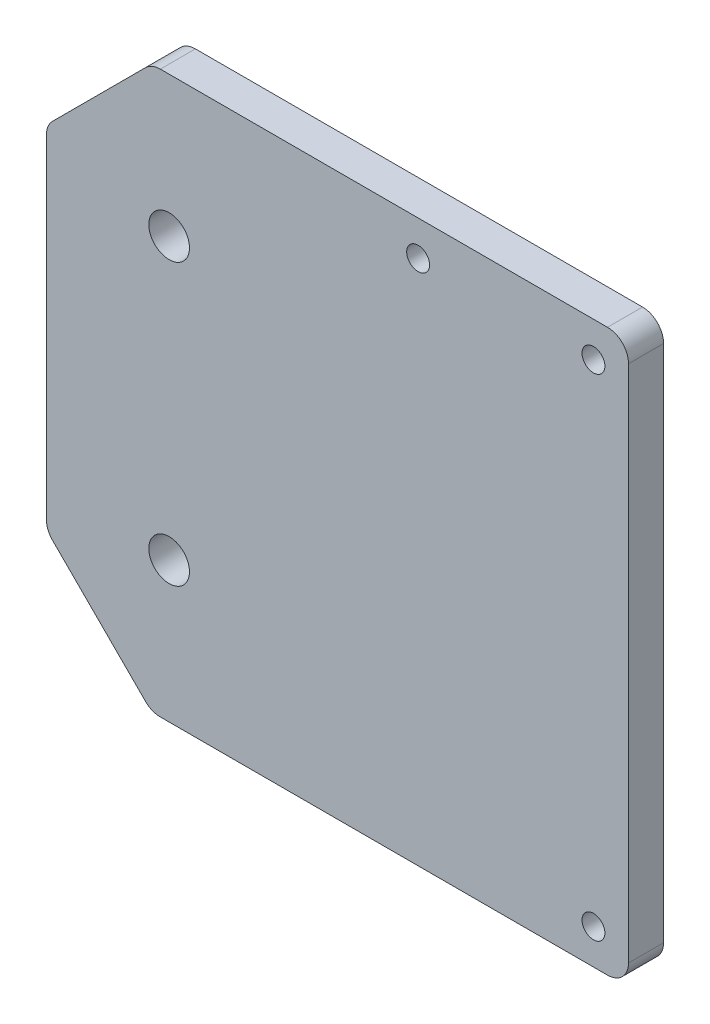
ISO-10303-21;
HEADER;
FILE_DESCRIPTION(('STEP AP214'),'2;1');
FILE_NAME('part.step','',(''),(''),'','','');
FILE_SCHEMA(('AUTOMOTIVE_DESIGN { 1 0 10303 214 1 1 1 1 }'));
ENDSEC;
DATA;
#1=APPLICATION_CONTEXT('core data for automotive mechanical design processes');
#2=APPLICATION_PROTOCOL_DEFINITION('international standard','automotive_design',2000,#1);
#3=PRODUCT_CONTEXT('',#1,'mechanical');
#4=PRODUCT('Part','Part','',(#3));
#5=PRODUCT_RELATED_PRODUCT_CATEGORY('part','',(#4));
#6=PRODUCT_DEFINITION_FORMATION('','',#4);
#7=PRODUCT_DEFINITION_CONTEXT('part definition',#1,'design');
#8=PRODUCT_DEFINITION('design','',#6,#7);
#9=PRODUCT_DEFINITION_SHAPE('','',#8);
#10=(LENGTH_UNIT() NAMED_UNIT(*) SI_UNIT(.MILLI.,.METRE.));
#11=(NAMED_UNIT(*) PLANE_ANGLE_UNIT() SI_UNIT($,.RADIAN.));
#12=(NAMED_UNIT(*) SI_UNIT($,.STERADIAN.) SOLID_ANGLE_UNIT());
#13=UNCERTAINTY_MEASURE_WITH_UNIT(LENGTH_MEASURE(1.E-05),#10,'distance_accuracy_value','');
#14=(GEOMETRIC_REPRESENTATION_CONTEXT(3) GLOBAL_UNCERTAINTY_ASSIGNED_CONTEXT((#13)) GLOBAL_UNIT_ASSIGNED_CONTEXT((#10,
#11,#12)) REPRESENTATION_CONTEXT('',''));
#15=CARTESIAN_POINT('',(0.,0.,0.));
#16=DIRECTION('',(0.,0.,1.));
#17=DIRECTION('',(1.,0.,0.));
#18=AXIS2_PLACEMENT_3D('',#15,#16,#17);
#19=CARTESIAN_POINT('',(0.,40.,5.));
#20=DIRECTION('',(0.,1.,0.));
#21=DIRECTION('',(0.,0.,1.));
#22=AXIS2_PLACEMENT_3D('',#19,#20,#21);
#23=PLANE('',#22);
#24=DIRECTION('',(1.,0.,0.));
#25=VECTOR('',#24,1.);
#26=CARTESIAN_POINT('',(0.,40.,0.));
#27=LINE('',#26,#25);
#28=CARTESIAN_POINT('',(-23.5332044962727,40.,0.));
#29=VERTEX_POINT('',#28);
#30=CARTESIAN_POINT('',(40.224154816608,40.,0.));
#31=VERTEX_POINT('',#30);
#32=EDGE_CURVE('E237',#29,#31,#27,.T.);
#33=ORIENTED_EDGE('',*,*,#32,.F.);
#34=DIRECTION('',(0.,0.,1.));
#35=VECTOR('',#34,1.);
#36=CARTESIAN_POINT('',(-23.5332044962727,40.,5.));
#37=LINE('',#36,#35);
#38=CARTESIAN_POINT('',(-23.5332044962727,40.,5.));
#39=VERTEX_POINT('',#38);
#40=EDGE_CURVE('E175',#29,#39,#37,.T.);
#41=ORIENTED_EDGE('',*,*,#40,.T.);
#42=DIRECTION('',(1.,0.,0.));
#43=VECTOR('',#42,1.);
#44=CARTESIAN_POINT('',(0.,40.,5.));
#45=LINE('',#44,#43);
#46=CARTESIAN_POINT('',(40.224154816608,40.,5.));
#47=VERTEX_POINT('',#46);
#48=EDGE_CURVE('E188',#39,#47,#45,.T.);
#49=ORIENTED_EDGE('',*,*,#48,.T.);
#50=DIRECTION('',(0.,0.,-1.));
#51=VECTOR('',#50,1.);
#52=CARTESIAN_POINT('',(40.224154816608,40.,5.));
#53=LINE('',#52,#51);
#54=EDGE_CURVE('E172',#47,#31,#53,.T.);
#55=ORIENTED_EDGE('',*,*,#54,.T.);
#56=EDGE_LOOP('',(#33,#41,#49,#55));
#57=FACE_BOUND('',#56,.T.);
#58=ADVANCED_FACE('F34',(#57),#23,.T.);
#59=CARTESIAN_POINT('',(-39.775845183392,0.,5.));
#60=DIRECTION('',(1.,0.,0.));
#61=DIRECTION('',(0.,0.,-1.));
#62=AXIS2_PLACEMENT_3D('',#59,#60,#61);
#63=PLANE('',#62);
#64=DIRECTION('',(0.,-1.,0.));
#65=VECTOR('',#64,1.);
#66=CARTESIAN_POINT('',(-39.775845183392,0.,0.));
#67=LINE('',#66,#65);
#68=CARTESIAN_POINT('',(-39.775845183392,23.7573593128807,0.));
#69=VERTEX_POINT('',#68);
#70=CARTESIAN_POINT('',(-39.775845183392,-23.7573593128807,0.));
#71=VERTEX_POINT('',#70);
#72=EDGE_CURVE('E192',#69,#71,#67,.T.);
#73=ORIENTED_EDGE('',*,*,#72,.T.);
#74=DIRECTION('',(0.,0.,1.));
#75=VECTOR('',#74,1.);
#76=CARTESIAN_POINT('',(-39.775845183392,-23.7573593128807,5.));
#77=LINE('',#76,#75);
#78=CARTESIAN_POINT('',(-39.775845183392,-23.7573593128807,5.));
#79=VERTEX_POINT('',#78);
#80=EDGE_CURVE('E166',#71,#79,#77,.T.);
#81=ORIENTED_EDGE('',*,*,#80,.T.);
#82=DIRECTION('',(0.,-1.,0.));
#83=VECTOR('',#82,1.);
#84=CARTESIAN_POINT('',(-39.775845183392,0.,5.));
#85=LINE('',#84,#83);
#86=CARTESIAN_POINT('',(-39.775845183392,23.7573593128807,5.));
#87=VERTEX_POINT('',#86);
#88=EDGE_CURVE('E145',#87,#79,#85,.T.);
#89=ORIENTED_EDGE('',*,*,#88,.F.);
#90=DIRECTION('',(0.,0.,-1.));
#91=VECTOR('',#90,1.);
#92=CARTESIAN_POINT('',(-39.775845183392,23.7573593128807,0.));
#93=LINE('',#92,#91);
#94=EDGE_CURVE('E163',#87,#69,#93,.T.);
#95=ORIENTED_EDGE('',*,*,#94,.T.);
#96=EDGE_LOOP('',(#73,#81,#89,#95));
#97=FACE_BOUND('',#96,.T.);
#98=ADVANCED_FACE('F230',(#97),#63,.F.);
#99=CARTESIAN_POINT('',(0.,-40.,5.));
#100=DIRECTION('',(0.,-1.,0.));
#101=DIRECTION('',(0.,0.,-1.));
#102=AXIS2_PLACEMENT_3D('',#99,#100,#101);
#103=PLANE('',#102);
#104=DIRECTION('',(-1.,0.,0.));
#105=VECTOR('',#104,1.);
#106=CARTESIAN_POINT('',(0.,-40.,5.));
#107=LINE('',#106,#105);
#108=CARTESIAN_POINT('',(40.224154816608,-40.,5.));
#109=VERTEX_POINT('',#108);
#110=CARTESIAN_POINT('',(-23.5332044962727,-40.,5.));
#111=VERTEX_POINT('',#110);
#112=EDGE_CURVE('E128',#109,#111,#107,.T.);
#113=ORIENTED_EDGE('',*,*,#112,.T.);
#114=DIRECTION('',(0.,0.,-1.));
#115=VECTOR('',#114,1.);
#116=CARTESIAN_POINT('',(-23.5332044962727,-40.,5.));
#117=LINE('',#116,#115);
#118=CARTESIAN_POINT('',(-23.5332044962727,-40.,0.));
#119=VERTEX_POINT('',#118);
#120=EDGE_CURVE('E134',#111,#119,#117,.T.);
#121=ORIENTED_EDGE('',*,*,#120,.T.);
#122=DIRECTION('',(-1.,0.,0.));
#123=VECTOR('',#122,1.);
#124=CARTESIAN_POINT('',(0.,-40.,0.));
#125=LINE('',#124,#123);
#126=CARTESIAN_POINT('',(40.224154816608,-40.,0.));
#127=VERTEX_POINT('',#126);
#128=EDGE_CURVE('E131',#127,#119,#125,.T.);
#129=ORIENTED_EDGE('',*,*,#128,.F.);
#130=DIRECTION('',(0.,0.,-1.));
#131=VECTOR('',#130,1.);
#132=CARTESIAN_POINT('',(40.224154816608,-40.,5.));
#133=LINE('',#132,#131);
#134=EDGE_CURVE('E124',#127,#109,#133,.F.);
#135=ORIENTED_EDGE('',*,*,#134,.T.);
#136=EDGE_LOOP('',(#113,#121,#129,#135));
#137=FACE_BOUND('',#136,.T.);
#138=ADVANCED_FACE('F126',(#137),#103,.T.);
#139=CARTESIAN_POINT('',(43.224154816608,0.,5.));
#140=DIRECTION('',(1.,0.,0.));
#141=DIRECTION('',(0.,0.,-1.));
#142=AXIS2_PLACEMENT_3D('',#139,#140,#141);
#143=PLANE('',#142);
#144=DIRECTION('',(0.,-1.,0.));
#145=VECTOR('',#144,1.);
#146=CARTESIAN_POINT('',(43.224154816608,0.,0.));
#147=LINE('',#146,#145);
#148=CARTESIAN_POINT('',(43.224154816608,37.,0.));
#149=VERTEX_POINT('',#148);
#150=CARTESIAN_POINT('',(43.224154816608,-37.,0.));
#151=VERTEX_POINT('',#150);
#152=EDGE_CURVE('E181',#149,#151,#147,.T.);
#153=ORIENTED_EDGE('',*,*,#152,.F.);
#154=DIRECTION('',(0.,0.,-1.));
#155=VECTOR('',#154,1.);
#156=CARTESIAN_POINT('',(43.224154816608,37.,5.));
#157=LINE('',#156,#155);
#158=CARTESIAN_POINT('',(43.224154816608,37.,5.));
#159=VERTEX_POINT('',#158);
#160=EDGE_CURVE('E11',#149,#159,#157,.F.);
#161=ORIENTED_EDGE('',*,*,#160,.T.);
#162=DIRECTION('',(0.,-1.,0.));
#163=VECTOR('',#162,1.);
#164=CARTESIAN_POINT('',(43.224154816608,0.,5.));
#165=LINE('',#164,#163);
#166=CARTESIAN_POINT('',(43.224154816608,-37.,5.));
#167=VERTEX_POINT('',#166);
#168=EDGE_CURVE('E144',#159,#167,#165,.T.);
#169=ORIENTED_EDGE('',*,*,#168,.T.);
#170=DIRECTION('',(0.,0.,-1.));
#171=VECTOR('',#170,1.);
#172=CARTESIAN_POINT('',(43.224154816608,-37.,5.));
#173=LINE('',#172,#171);
#174=EDGE_CURVE('E42',#167,#151,#173,.T.);
#175=ORIENTED_EDGE('',*,*,#174,.T.);
#176=EDGE_LOOP('',(#153,#161,#169,#175));
#177=FACE_BOUND('',#176,.T.);
#178=ADVANCED_FACE('F180',(#177),#143,.T.);
#179=CARTESIAN_POINT('',(0.,0.,5.));
#180=DIRECTION('',(0.,0.,1.));
#181=DIRECTION('',(1.,0.,0.));
#182=AXIS2_PLACEMENT_3D('',#179,#180,#181);
#183=PLANE('',#182);
#184=CARTESIAN_POINT('',(13.224154816608,35.,5.));
#185=DIRECTION('',(0.,0.,1.));
#186=DIRECTION('',(1.,0.,0.));
#187=AXIS2_PLACEMENT_3D('',#184,#185,#186);
#188=CIRCLE('',#187,1.63195);
#189=CARTESIAN_POINT('',(14.856104816608,35.,5.));
#190=VERTEX_POINT('',#189);
#191=EDGE_CURVE('E268',#190,#190,#188,.T.);
#192=ORIENTED_EDGE('',*,*,#191,.F.);
#193=EDGE_LOOP('',(#192));
#194=FACE_BOUND('',#193,.T.);
#195=CARTESIAN_POINT('',(38.224154816608,35.,5.));
#196=DIRECTION('',(0.,0.,1.));
#197=DIRECTION('',(1.,0.,0.));
#198=AXIS2_PLACEMENT_3D('',#195,#196,#197);
#199=CIRCLE('',#198,1.63195);
#200=CARTESIAN_POINT('',(39.856104816608,35.,5.));
#201=VERTEX_POINT('',#200);
#202=EDGE_CURVE('E262',#201,#201,#199,.T.);
#203=ORIENTED_EDGE('',*,*,#202,.F.);
#204=EDGE_LOOP('',(#203));
#205=FACE_BOUND('',#204,.T.);
#206=CARTESIAN_POINT('',(38.224154816608,-35.,5.));
#207=DIRECTION('',(0.,0.,1.));
#208=DIRECTION('',(1.,0.,0.));
#209=AXIS2_PLACEMENT_3D('',#206,#207,#208);
#210=CIRCLE('',#209,1.63195);
#211=CARTESIAN_POINT('',(39.856104816608,-35.,5.));
#212=VERTEX_POINT('',#211);
#213=EDGE_CURVE('E256',#212,#212,#210,.T.);
#214=ORIENTED_EDGE('',*,*,#213,.F.);
#215=EDGE_LOOP('',(#214));
#216=FACE_BOUND('',#215,.T.);
#217=CARTESIAN_POINT('',(-22.275845183392,-20.,5.));
#218=DIRECTION('',(0.,0.,1.));
#219=DIRECTION('',(1.,0.,0.));
#220=AXIS2_PLACEMENT_3D('',#217,#218,#219);
#221=CIRCLE('',#220,2.9);
#222=CARTESIAN_POINT('',(-19.375845183392,-20.,5.));
#223=VERTEX_POINT('',#222);
#224=EDGE_CURVE('E250',#223,#223,#221,.T.);
#225=ORIENTED_EDGE('',*,*,#224,.F.);
#226=EDGE_LOOP('',(#225));
#227=FACE_BOUND('',#226,.T.);
#228=CARTESIAN_POINT('',(-22.275845183392,20.,5.));
#229=DIRECTION('',(0.,0.,1.));
#230=DIRECTION('',(1.,0.,0.));
#231=AXIS2_PLACEMENT_3D('',#228,#229,#230);
#232=CIRCLE('',#231,2.9);
#233=CARTESIAN_POINT('',(-19.375845183392,20.,5.));
#234=VERTEX_POINT('',#233);
#235=EDGE_CURVE('E241',#234,#234,#232,.T.);
#236=ORIENTED_EDGE('',*,*,#235,.F.);
#237=EDGE_LOOP('',(#236));
#238=FACE_BOUND('',#237,.T.);
#239=DIRECTION('',(0.707106781186546,-0.707106781186549,0.));
#240=VECTOR('',#239,1.);
#241=CARTESIAN_POINT('',(-32.3879225916961,-32.3879225916959,5.));
#242=LINE('',#241,#240);
#243=CARTESIAN_POINT('',(-38.8971655269517,-25.8786796564403,5.));
#244=VERTEX_POINT('',#243);
#245=CARTESIAN_POINT('',(-25.6545248398324,-39.1213203435596,5.));
#246=VERTEX_POINT('',#245);
#247=EDGE_CURVE('E135',#244,#246,#242,.T.);
#248=ORIENTED_EDGE('',*,*,#247,.T.);
#249=CARTESIAN_POINT('',(-23.5332044962727,-37.,5.));
#250=DIRECTION('',(0.,0.,1.));
#251=DIRECTION('',(1.,0.,0.));
#252=AXIS2_PLACEMENT_3D('',#249,#250,#251);
#253=CIRCLE('',#252,3.);
#254=EDGE_CURVE('E143',#246,#111,#253,.T.);
#255=ORIENTED_EDGE('',*,*,#254,.T.);
#256=ORIENTED_EDGE('',*,*,#112,.F.);
#257=CARTESIAN_POINT('',(40.224154816608,-37.,5.));
#258=DIRECTION('',(0.,0.,1.));
#259=DIRECTION('',(1.,0.,0.));
#260=AXIS2_PLACEMENT_3D('',#257,#258,#259);
#261=CIRCLE('',#260,3.);
#262=EDGE_CURVE('E140',#109,#167,#261,.T.);
#263=ORIENTED_EDGE('',*,*,#262,.T.);
#264=ORIENTED_EDGE('',*,*,#168,.F.);
#265=CARTESIAN_POINT('',(40.224154816608,37.,5.));
#266=DIRECTION('',(0.,0.,1.));
#267=DIRECTION('',(1.,0.,0.));
#268=AXIS2_PLACEMENT_3D('',#265,#266,#267);
#269=CIRCLE('',#268,3.);
#270=EDGE_CURVE('E149',#159,#47,#269,.T.);
#271=ORIENTED_EDGE('',*,*,#270,.T.);
#272=ORIENTED_EDGE('',*,*,#48,.F.);
#273=CARTESIAN_POINT('',(-23.5332044962727,37.,5.));
#274=DIRECTION('',(0.,0.,1.));
#275=DIRECTION('',(1.,0.,0.));
#276=AXIS2_PLACEMENT_3D('',#273,#274,#275);
#277=CIRCLE('',#276,3.);
#278=CARTESIAN_POINT('',(-25.6545248398323,39.1213203435596,5.));
#279=VERTEX_POINT('',#278);
#280=EDGE_CURVE('E56',#39,#279,#277,.T.);
#281=ORIENTED_EDGE('',*,*,#280,.T.);
#282=DIRECTION('',(-0.707106781186549,-0.707106781186546,0.));
#283=VECTOR('',#282,1.);
#284=CARTESIAN_POINT('',(-32.3879225916959,32.3879225916961,5.));
#285=LINE('',#284,#283);
#286=CARTESIAN_POINT('',(-38.8971655269516,25.8786796564404,5.));
#287=VERTEX_POINT('',#286);
#288=EDGE_CURVE('E202',#279,#287,#285,.T.);
#289=ORIENTED_EDGE('',*,*,#288,.T.);
#290=CARTESIAN_POINT('',(-36.775845183392,23.7573593128807,5.));
#291=DIRECTION('',(0.,0.,1.));
#292=DIRECTION('',(1.,0.,0.));
#293=AXIS2_PLACEMENT_3D('',#290,#291,#292);
#294=CIRCLE('',#293,3.);
#295=EDGE_CURVE('E158',#287,#87,#294,.T.);
#296=ORIENTED_EDGE('',*,*,#295,.T.);
#297=ORIENTED_EDGE('',*,*,#88,.T.);
#298=CARTESIAN_POINT('',(-36.775845183392,-23.7573593128807,5.));
#299=DIRECTION('',(0.,0.,1.));
#300=DIRECTION('',(1.,0.,0.));
#301=AXIS2_PLACEMENT_3D('',#298,#299,#300);
#302=CIRCLE('',#301,3.);
#303=EDGE_CURVE('E160',#79,#244,#302,.T.);
#304=ORIENTED_EDGE('',*,*,#303,.T.);
#305=EDGE_LOOP('',(#248,#255,#256,#263,#264,#271,#272,#281,#289,#296,#297,#304));
#306=FACE_BOUND('',#305,.T.);
#307=ADVANCED_FACE('F138',(#194,#205,#216,#227,#238,#306),#183,.T.);
#308=CARTESIAN_POINT('',(0.,0.,0.));
#309=DIRECTION('',(0.,0.,1.));
#310=DIRECTION('',(1.,0.,0.));
#311=AXIS2_PLACEMENT_3D('',#308,#309,#310);
#312=PLANE('',#311);
#313=CARTESIAN_POINT('',(13.224154816608,35.,0.));
#314=DIRECTION('',(0.,0.,1.));
#315=DIRECTION('',(1.,0.,0.));
#316=AXIS2_PLACEMENT_3D('',#313,#314,#315);
#317=CIRCLE('',#316,1.63195);
#318=CARTESIAN_POINT('',(14.856104816608,35.,0.));
#319=VERTEX_POINT('',#318);
#320=EDGE_CURVE('E265',#319,#319,#317,.T.);
#321=ORIENTED_EDGE('',*,*,#320,.T.);
#322=EDGE_LOOP('',(#321));
#323=FACE_BOUND('',#322,.T.);
#324=CARTESIAN_POINT('',(38.224154816608,35.,0.));
#325=DIRECTION('',(0.,0.,1.));
#326=DIRECTION('',(1.,0.,0.));
#327=AXIS2_PLACEMENT_3D('',#324,#325,#326);
#328=CIRCLE('',#327,1.63195);
#329=CARTESIAN_POINT('',(39.856104816608,35.,0.));
#330=VERTEX_POINT('',#329);
#331=EDGE_CURVE('E259',#330,#330,#328,.T.);
#332=ORIENTED_EDGE('',*,*,#331,.T.);
#333=EDGE_LOOP('',(#332));
#334=FACE_BOUND('',#333,.T.);
#335=CARTESIAN_POINT('',(38.224154816608,-35.,0.));
#336=DIRECTION('',(0.,0.,1.));
#337=DIRECTION('',(1.,0.,0.));
#338=AXIS2_PLACEMENT_3D('',#335,#336,#337);
#339=CIRCLE('',#338,1.63195);
#340=CARTESIAN_POINT('',(39.856104816608,-35.,0.));
#341=VERTEX_POINT('',#340);
#342=EDGE_CURVE('E253',#341,#341,#339,.T.);
#343=ORIENTED_EDGE('',*,*,#342,.T.);
#344=EDGE_LOOP('',(#343));
#345=FACE_BOUND('',#344,.T.);
#346=CARTESIAN_POINT('',(-22.275845183392,-20.,0.));
#347=DIRECTION('',(0.,0.,1.));
#348=DIRECTION('',(1.,0.,0.));
#349=AXIS2_PLACEMENT_3D('',#346,#347,#348);
#350=CIRCLE('',#349,2.9);
#351=CARTESIAN_POINT('',(-19.375845183392,-20.,0.));
#352=VERTEX_POINT('',#351);
#353=EDGE_CURVE('E245',#352,#352,#350,.T.);
#354=ORIENTED_EDGE('',*,*,#353,.T.);
#355=EDGE_LOOP('',(#354));
#356=FACE_BOUND('',#355,.T.);
#357=CARTESIAN_POINT('',(-22.275845183392,20.,0.));
#358=DIRECTION('',(0.,0.,1.));
#359=DIRECTION('',(1.,0.,0.));
#360=AXIS2_PLACEMENT_3D('',#357,#358,#359);
#361=CIRCLE('',#360,2.9);
#362=CARTESIAN_POINT('',(-19.375845183392,20.,0.));
#363=VERTEX_POINT('',#362);
#364=EDGE_CURVE('E238',#363,#363,#361,.T.);
#365=ORIENTED_EDGE('',*,*,#364,.T.);
#366=EDGE_LOOP('',(#365));
#367=FACE_BOUND('',#366,.T.);
#368=ORIENTED_EDGE('',*,*,#128,.T.);
#369=CARTESIAN_POINT('',(-23.5332044962727,-37.,0.));
#370=DIRECTION('',(0.,0.,1.));
#371=DIRECTION('',(1.,0.,0.));
#372=AXIS2_PLACEMENT_3D('',#369,#370,#371);
#373=CIRCLE('',#372,3.);
#374=CARTESIAN_POINT('',(-25.6545248398324,-39.1213203435596,0.));
#375=VERTEX_POINT('',#374);
#376=EDGE_CURVE('E214',#119,#375,#373,.F.);
#377=ORIENTED_EDGE('',*,*,#376,.T.);
#378=DIRECTION('',(-0.707106781186546,0.707106781186549,0.));
#379=VECTOR('',#378,1.);
#380=CARTESIAN_POINT('',(-24.775845183392,-40.,0.));
#381=LINE('',#380,#379);
#382=CARTESIAN_POINT('',(-38.8971655269517,-25.8786796564403,0.));
#383=VERTEX_POINT('',#382);
#384=EDGE_CURVE('E199',#375,#383,#381,.T.);
#385=ORIENTED_EDGE('',*,*,#384,.T.);
#386=CARTESIAN_POINT('',(-36.775845183392,-23.7573593128807,0.));
#387=DIRECTION('',(0.,0.,1.));
#388=DIRECTION('',(1.,0.,0.));
#389=AXIS2_PLACEMENT_3D('',#386,#387,#388);
#390=CIRCLE('',#389,3.);
#391=EDGE_CURVE('E212',#383,#71,#390,.F.);
#392=ORIENTED_EDGE('',*,*,#391,.T.);
#393=ORIENTED_EDGE('',*,*,#72,.F.);
#394=CARTESIAN_POINT('',(-36.775845183392,23.7573593128807,0.));
#395=DIRECTION('',(0.,0.,1.));
#396=DIRECTION('',(1.,0.,0.));
#397=AXIS2_PLACEMENT_3D('',#394,#395,#396);
#398=CIRCLE('',#397,3.);
#399=CARTESIAN_POINT('',(-38.8971655269516,25.8786796564404,0.));
#400=VERTEX_POINT('',#399);
#401=EDGE_CURVE('E210',#69,#400,#398,.F.);
#402=ORIENTED_EDGE('',*,*,#401,.T.);
#403=DIRECTION('',(0.707106781186549,0.707106781186546,0.));
#404=VECTOR('',#403,1.);
#405=CARTESIAN_POINT('',(-39.775845183392,25.,0.));
#406=LINE('',#405,#404);
#407=CARTESIAN_POINT('',(-25.6545248398323,39.1213203435596,0.));
#408=VERTEX_POINT('',#407);
#409=EDGE_CURVE('E196',#400,#408,#406,.T.);
#410=ORIENTED_EDGE('',*,*,#409,.T.);
#411=CARTESIAN_POINT('',(-23.5332044962727,37.,0.));
#412=DIRECTION('',(0.,0.,1.));
#413=DIRECTION('',(1.,0.,0.));
#414=AXIS2_PLACEMENT_3D('',#411,#412,#413);
#415=CIRCLE('',#414,3.);
#416=EDGE_CURVE('E208',#408,#29,#415,.F.);
#417=ORIENTED_EDGE('',*,*,#416,.T.);
#418=ORIENTED_EDGE('',*,*,#32,.T.);
#419=CARTESIAN_POINT('',(40.224154816608,37.,0.));
#420=DIRECTION('',(0.,0.,1.));
#421=DIRECTION('',(1.,0.,0.));
#422=AXIS2_PLACEMENT_3D('',#419,#420,#421);
#423=CIRCLE('',#422,3.);
#424=EDGE_CURVE('E187',#31,#149,#423,.F.);
#425=ORIENTED_EDGE('',*,*,#424,.T.);
#426=ORIENTED_EDGE('',*,*,#152,.T.);
#427=CARTESIAN_POINT('',(40.224154816608,-37.,0.));
#428=DIRECTION('',(0.,0.,1.));
#429=DIRECTION('',(1.,0.,0.));
#430=AXIS2_PLACEMENT_3D('',#427,#428,#429);
#431=CIRCLE('',#430,3.);
#432=EDGE_CURVE('E185',#151,#127,#431,.F.);
#433=ORIENTED_EDGE('',*,*,#432,.T.);
#434=EDGE_LOOP('',(#368,#377,#385,#392,#393,#402,#410,#417,#418,#425,#426,#433));
#435=FACE_BOUND('',#434,.T.);
#436=ADVANCED_FACE('F184',(#323,#334,#345,#356,#367,#435),#312,.F.);
#437=CARTESIAN_POINT('',(-22.275845183392,20.,5.));
#438=DIRECTION('',(0.,0.,1.));
#439=DIRECTION('',(1.,0.,0.));
#440=AXIS2_PLACEMENT_3D('',#437,#438,#439);
#441=CYLINDRICAL_SURFACE('',#440,2.9);
#442=ORIENTED_EDGE('',*,*,#364,.F.);
#443=EDGE_LOOP('',(#442));
#444=FACE_BOUND('',#443,.T.);
#445=ORIENTED_EDGE('',*,*,#235,.T.);
#446=EDGE_LOOP('',(#445));
#447=FACE_BOUND('',#446,.T.);
#448=ADVANCED_FACE('F285',(#444,#447),#441,.F.);
#449=CARTESIAN_POINT('',(-22.275845183392,-20.,5.));
#450=DIRECTION('',(0.,0.,1.));
#451=DIRECTION('',(1.,0.,0.));
#452=AXIS2_PLACEMENT_3D('',#449,#450,#451);
#453=CYLINDRICAL_SURFACE('',#452,2.9);
#454=ORIENTED_EDGE('',*,*,#353,.F.);
#455=EDGE_LOOP('',(#454));
#456=FACE_BOUND('',#455,.T.);
#457=ORIENTED_EDGE('',*,*,#224,.T.);
#458=EDGE_LOOP('',(#457));
#459=FACE_BOUND('',#458,.T.);
#460=ADVANCED_FACE('F287',(#456,#459),#453,.F.);
#461=CARTESIAN_POINT('',(-24.775845183392,-40.,5.));
#462=DIRECTION('',(-0.707106781186549,-0.707106781186546,0.));
#463=DIRECTION('',(0.,0.,1.));
#464=AXIS2_PLACEMENT_3D('',#461,#462,#463);
#465=PLANE('',#464);
#466=ORIENTED_EDGE('',*,*,#384,.F.);
#467=DIRECTION('',(0.,0.,-1.));
#468=VECTOR('',#467,1.);
#469=CARTESIAN_POINT('',(-25.6545248398324,-39.1213203435596,5.));
#470=LINE('',#469,#468);
#471=EDGE_CURVE('E150',#375,#246,#470,.F.);
#472=ORIENTED_EDGE('',*,*,#471,.T.);
#473=ORIENTED_EDGE('',*,*,#247,.F.);
#474=DIRECTION('',(0.,0.,1.));
#475=VECTOR('',#474,1.);
#476=CARTESIAN_POINT('',(-38.8971655269517,-25.8786796564403,0.));
#477=LINE('',#476,#475);
#478=EDGE_CURVE('E153',#244,#383,#477,.F.);
#479=ORIENTED_EDGE('',*,*,#478,.T.);
#480=EDGE_LOOP('',(#466,#472,#473,#479));
#481=FACE_BOUND('',#480,.T.);
#482=ADVANCED_FACE('F219',(#481),#465,.T.);
#483=CARTESIAN_POINT('',(-39.775845183392,25.,5.));
#484=DIRECTION('',(-0.707106781186546,0.707106781186549,0.));
#485=DIRECTION('',(0.,0.,1.));
#486=AXIS2_PLACEMENT_3D('',#483,#484,#485);
#487=PLANE('',#486);
#488=ORIENTED_EDGE('',*,*,#409,.F.);
#489=DIRECTION('',(0.,0.,-1.));
#490=VECTOR('',#489,1.);
#491=CARTESIAN_POINT('',(-38.8971655269516,25.8786796564404,5.));
#492=LINE('',#491,#490);
#493=EDGE_CURVE('E49',#400,#287,#492,.F.);
#494=ORIENTED_EDGE('',*,*,#493,.T.);
#495=ORIENTED_EDGE('',*,*,#288,.F.);
#496=DIRECTION('',(0.,0.,1.));
#497=VECTOR('',#496,1.);
#498=CARTESIAN_POINT('',(-25.6545248398323,39.1213203435596,5.));
#499=LINE('',#498,#497);
#500=EDGE_CURVE('E169',#279,#408,#499,.F.);
#501=ORIENTED_EDGE('',*,*,#500,.T.);
#502=EDGE_LOOP('',(#488,#494,#495,#501));
#503=FACE_BOUND('',#502,.T.);
#504=ADVANCED_FACE('F309',(#503),#487,.T.);
#505=CARTESIAN_POINT('',(-23.5332044962727,-37.,5.));
#506=DIRECTION('',(0.,0.,-1.));
#507=DIRECTION('',(-1.,0.,0.));
#508=AXIS2_PLACEMENT_3D('',#505,#506,#507);
#509=CYLINDRICAL_SURFACE('',#508,3.);
#510=ORIENTED_EDGE('',*,*,#254,.F.);
#511=ORIENTED_EDGE('',*,*,#471,.F.);
#512=ORIENTED_EDGE('',*,*,#376,.F.);
#513=ORIENTED_EDGE('',*,*,#120,.F.);
#514=EDGE_LOOP('',(#510,#511,#512,#513));
#515=FACE_BOUND('',#514,.T.);
#516=ADVANCED_FACE('F312',(#515),#509,.T.);
#517=CARTESIAN_POINT('',(-36.775845183392,-23.7573593128807,5.));
#518=DIRECTION('',(0.,0.,-1.));
#519=DIRECTION('',(-1.,0.,0.));
#520=AXIS2_PLACEMENT_3D('',#517,#518,#519);
#521=CYLINDRICAL_SURFACE('',#520,3.);
#522=ORIENTED_EDGE('',*,*,#391,.F.);
#523=ORIENTED_EDGE('',*,*,#478,.F.);
#524=ORIENTED_EDGE('',*,*,#303,.F.);
#525=ORIENTED_EDGE('',*,*,#80,.F.);
#526=EDGE_LOOP('',(#522,#523,#524,#525));
#527=FACE_BOUND('',#526,.T.);
#528=ADVANCED_FACE('F226',(#527),#521,.T.);
#529=CARTESIAN_POINT('',(-36.775845183392,23.7573593128807,5.));
#530=DIRECTION('',(0.,0.,1.));
#531=DIRECTION('',(1.,0.,0.));
#532=AXIS2_PLACEMENT_3D('',#529,#530,#531);
#533=CYLINDRICAL_SURFACE('',#532,3.);
#534=ORIENTED_EDGE('',*,*,#295,.F.);
#535=ORIENTED_EDGE('',*,*,#493,.F.);
#536=ORIENTED_EDGE('',*,*,#401,.F.);
#537=ORIENTED_EDGE('',*,*,#94,.F.);
#538=EDGE_LOOP('',(#534,#535,#536,#537));
#539=FACE_BOUND('',#538,.T.);
#540=ADVANCED_FACE('F318',(#539),#533,.T.);
#541=CARTESIAN_POINT('',(-23.5332044962727,37.,5.));
#542=DIRECTION('',(0.,0.,1.));
#543=DIRECTION('',(1.,0.,0.));
#544=AXIS2_PLACEMENT_3D('',#541,#542,#543);
#545=CYLINDRICAL_SURFACE('',#544,3.);
#546=ORIENTED_EDGE('',*,*,#416,.F.);
#547=ORIENTED_EDGE('',*,*,#500,.F.);
#548=ORIENTED_EDGE('',*,*,#280,.F.);
#549=ORIENTED_EDGE('',*,*,#40,.F.);
#550=EDGE_LOOP('',(#546,#547,#548,#549));
#551=FACE_BOUND('',#550,.T.);
#552=ADVANCED_FACE('F321',(#551),#545,.T.);
#553=CARTESIAN_POINT('',(40.224154816608,37.,5.));
#554=DIRECTION('',(0.,0.,-1.));
#555=DIRECTION('',(-1.,0.,0.));
#556=AXIS2_PLACEMENT_3D('',#553,#554,#555);
#557=CYLINDRICAL_SURFACE('',#556,3.);
#558=ORIENTED_EDGE('',*,*,#270,.F.);
#559=ORIENTED_EDGE('',*,*,#160,.F.);
#560=ORIENTED_EDGE('',*,*,#424,.F.);
#561=ORIENTED_EDGE('',*,*,#54,.F.);
#562=EDGE_LOOP('',(#558,#559,#560,#561));
#563=FACE_BOUND('',#562,.T.);
#564=ADVANCED_FACE('F324',(#563),#557,.T.);
#565=CARTESIAN_POINT('',(40.224154816608,-37.,5.));
#566=DIRECTION('',(0.,0.,-1.));
#567=DIRECTION('',(-1.,0.,0.));
#568=AXIS2_PLACEMENT_3D('',#565,#566,#567);
#569=CYLINDRICAL_SURFACE('',#568,3.);
#570=ORIENTED_EDGE('',*,*,#262,.F.);
#571=ORIENTED_EDGE('',*,*,#134,.F.);
#572=ORIENTED_EDGE('',*,*,#432,.F.);
#573=ORIENTED_EDGE('',*,*,#174,.F.);
#574=EDGE_LOOP('',(#570,#571,#572,#573));
#575=FACE_BOUND('',#574,.T.);
#576=ADVANCED_FACE('F36',(#575),#569,.T.);
#577=CARTESIAN_POINT('',(38.224154816608,-35.,5.));
#578=DIRECTION('',(0.,0.,1.));
#579=DIRECTION('',(1.,0.,0.));
#580=AXIS2_PLACEMENT_3D('',#577,#578,#579);
#581=CYLINDRICAL_SURFACE('',#580,1.63195);
#582=ORIENTED_EDGE('',*,*,#342,.F.);
#583=EDGE_LOOP('',(#582));
#584=FACE_BOUND('',#583,.T.);
#585=ORIENTED_EDGE('',*,*,#213,.T.);
#586=EDGE_LOOP('',(#585));
#587=FACE_BOUND('',#586,.T.);
#588=ADVANCED_FACE('F331',(#584,#587),#581,.F.);
#589=CARTESIAN_POINT('',(38.224154816608,35.,5.));
#590=DIRECTION('',(0.,0.,1.));
#591=DIRECTION('',(1.,0.,0.));
#592=AXIS2_PLACEMENT_3D('',#589,#590,#591);
#593=CYLINDRICAL_SURFACE('',#592,1.63195);
#594=ORIENTED_EDGE('',*,*,#331,.F.);
#595=EDGE_LOOP('',(#594));
#596=FACE_BOUND('',#595,.T.);
#597=ORIENTED_EDGE('',*,*,#202,.T.);
#598=EDGE_LOOP('',(#597));
#599=FACE_BOUND('',#598,.T.);
#600=ADVANCED_FACE('F340',(#596,#599),#593,.F.);
#601=CARTESIAN_POINT('',(13.224154816608,35.,5.));
#602=DIRECTION('',(0.,0.,1.));
#603=DIRECTION('',(1.,0.,0.));
#604=AXIS2_PLACEMENT_3D('',#601,#602,#603);
#605=CYLINDRICAL_SURFACE('',#604,1.63195);
#606=ORIENTED_EDGE('',*,*,#320,.F.);
#607=EDGE_LOOP('',(#606));
#608=FACE_BOUND('',#607,.T.);
#609=ORIENTED_EDGE('',*,*,#191,.T.);
#610=EDGE_LOOP('',(#609));
#611=FACE_BOUND('',#610,.T.);
#612=ADVANCED_FACE('F272',(#608,#611),#605,.F.);
#613=CLOSED_SHELL('',(#58,#98,#138,#178,#307,#436,#448,#460,#482,#504,#516,#528,#540,#552,#564,
#576,#588,#600,#612));
#614=MANIFOLD_SOLID_BREP('B2',#613);
#615=ADVANCED_BREP_SHAPE_REPRESENTATION('',(#18,#614),#14);
#616=SHAPE_DEFINITION_REPRESENTATION(#9,#615);
ENDSEC;
END-ISO-10303-21;
